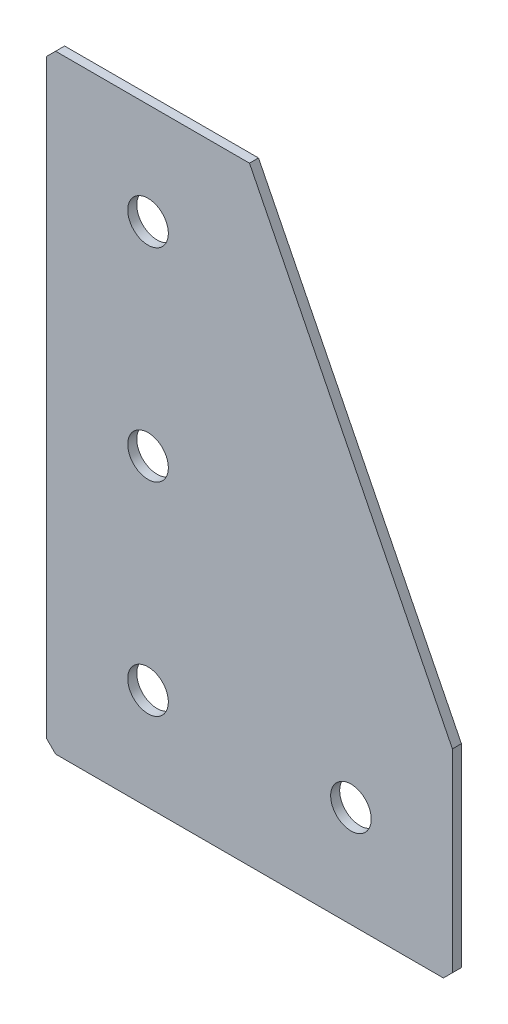
ISO-10303-21;
HEADER;
FILE_DESCRIPTION(('STEP AP214'),'2;1');
FILE_NAME('part.step','',(''),(''),'','','');
FILE_SCHEMA(('AUTOMOTIVE_DESIGN { 1 0 10303 214 1 1 1 1 }'));
ENDSEC;
DATA;
#1=APPLICATION_CONTEXT('core data for automotive mechanical design processes');
#2=APPLICATION_PROTOCOL_DEFINITION('international standard','automotive_design',2000,#1);
#3=PRODUCT_CONTEXT('',#1,'mechanical');
#4=PRODUCT('Part','Part','',(#3));
#5=PRODUCT_RELATED_PRODUCT_CATEGORY('part','',(#4));
#6=PRODUCT_DEFINITION_FORMATION('','',#4);
#7=PRODUCT_DEFINITION_CONTEXT('part definition',#1,'design');
#8=PRODUCT_DEFINITION('design','',#6,#7);
#9=PRODUCT_DEFINITION_SHAPE('','',#8);
#10=(LENGTH_UNIT() NAMED_UNIT(*) SI_UNIT(.MILLI.,.METRE.));
#11=(NAMED_UNIT(*) PLANE_ANGLE_UNIT() SI_UNIT($,.RADIAN.));
#12=(NAMED_UNIT(*) SI_UNIT($,.STERADIAN.) SOLID_ANGLE_UNIT());
#13=UNCERTAINTY_MEASURE_WITH_UNIT(LENGTH_MEASURE(1.E-05),#10,'distance_accuracy_value','');
#14=(GEOMETRIC_REPRESENTATION_CONTEXT(3) GLOBAL_UNCERTAINTY_ASSIGNED_CONTEXT((#13)) GLOBAL_UNIT_ASSIGNED_CONTEXT((#10,
#11,#12)) REPRESENTATION_CONTEXT('',''));
#15=CARTESIAN_POINT('',(0.,0.,0.));
#16=DIRECTION('',(0.,0.,1.));
#17=DIRECTION('',(1.,0.,0.));
#18=AXIS2_PLACEMENT_3D('',#15,#16,#17);
#19=CARTESIAN_POINT('',(45.,0.,-2.));
#20=DIRECTION('',(0.,-1.,0.));
#21=DIRECTION('',(1.,0.,0.));
#22=AXIS2_PLACEMENT_3D('',#19,#20,#21);
#23=PLANE('',#22);
#24=DIRECTION('',(1.,0.,0.));
#25=VECTOR('',#24,1.);
#26=CARTESIAN_POINT('',(45.,0.,-2.));
#27=LINE('',#26,#25);
#28=CARTESIAN_POINT('',(2.,0.,-2.));
#29=VERTEX_POINT('',#28);
#30=CARTESIAN_POINT('',(45.,0.,-2.));
#31=VERTEX_POINT('',#30);
#32=EDGE_CURVE('E110',#29,#31,#27,.T.);
#33=ORIENTED_EDGE('',*,*,#32,.F.);
#34=DIRECTION('',(0.,0.,1.));
#35=VECTOR('',#34,1.);
#36=CARTESIAN_POINT('',(1.99999999999999,0.,-2.));
#37=LINE('',#36,#35);
#38=CARTESIAN_POINT('',(2.,0.,0.));
#39=VERTEX_POINT('',#38);
#40=EDGE_CURVE('E139',#29,#39,#37,.T.);
#41=ORIENTED_EDGE('',*,*,#40,.T.);
#42=DIRECTION('',(1.,0.,0.));
#43=VECTOR('',#42,1.);
#44=CARTESIAN_POINT('',(45.,0.,0.));
#45=LINE('',#44,#43);
#46=CARTESIAN_POINT('',(45.,0.,0.));
#47=VERTEX_POINT('',#46);
#48=EDGE_CURVE('E136',#39,#47,#45,.T.);
#49=ORIENTED_EDGE('',*,*,#48,.T.);
#50=DIRECTION('',(0.,0.,1.));
#51=VECTOR('',#50,1.);
#52=CARTESIAN_POINT('',(45.,0.,-2.));
#53=LINE('',#52,#51);
#54=EDGE_CURVE('E128',#31,#47,#53,.T.);
#55=ORIENTED_EDGE('',*,*,#54,.F.);
#56=EDGE_LOOP('',(#33,#41,#49,#55));
#57=FACE_BOUND('',#56,.T.);
#58=ADVANCED_FACE('F45',(#57),#23,.F.);
#59=CARTESIAN_POINT('',(90.,-90.,-2.));
#60=DIRECTION('',(-0.894427190999916,-0.447213595499958,0.));
#61=DIRECTION('',(0.447213595499958,-0.894427190999916,0.));
#62=AXIS2_PLACEMENT_3D('',#59,#60,#61);
#63=PLANE('',#62);
#64=DIRECTION('',(0.447213595499958,-0.894427190999916,0.));
#65=VECTOR('',#64,1.);
#66=CARTESIAN_POINT('',(90.,-90.,0.));
#67=LINE('',#66,#65);
#68=CARTESIAN_POINT('',(90.,-90.,0.));
#69=VERTEX_POINT('',#68);
#70=EDGE_CURVE('E197',#47,#69,#67,.T.);
#71=ORIENTED_EDGE('',*,*,#70,.T.);
#72=DIRECTION('',(0.,0.,1.));
#73=VECTOR('',#72,1.);
#74=CARTESIAN_POINT('',(90.,-90.,-2.));
#75=LINE('',#74,#73);
#76=CARTESIAN_POINT('',(90.,-90.,-2.));
#77=VERTEX_POINT('',#76);
#78=EDGE_CURVE('E130',#77,#69,#75,.T.);
#79=ORIENTED_EDGE('',*,*,#78,.F.);
#80=DIRECTION('',(0.447213595499958,-0.894427190999916,0.));
#81=VECTOR('',#80,1.);
#82=CARTESIAN_POINT('',(90.,-90.,-2.));
#83=LINE('',#82,#81);
#84=EDGE_CURVE('E114',#31,#77,#83,.T.);
#85=ORIENTED_EDGE('',*,*,#84,.F.);
#86=ORIENTED_EDGE('',*,*,#54,.T.);
#87=EDGE_LOOP('',(#71,#79,#85,#86));
#88=FACE_BOUND('',#87,.T.);
#89=ADVANCED_FACE('F127',(#88),#63,.F.);
#90=CARTESIAN_POINT('',(90.,-135.,-2.));
#91=DIRECTION('',(-1.,0.,0.));
#92=DIRECTION('',(0.,0.,1.));
#93=AXIS2_PLACEMENT_3D('',#90,#91,#92);
#94=PLANE('',#93);
#95=DIRECTION('',(0.,-1.,0.));
#96=VECTOR('',#95,1.);
#97=CARTESIAN_POINT('',(90.,-135.,0.));
#98=LINE('',#97,#96);
#99=CARTESIAN_POINT('',(90.,-133.,0.));
#100=VERTEX_POINT('',#99);
#101=EDGE_CURVE('E190',#69,#100,#98,.T.);
#102=ORIENTED_EDGE('',*,*,#101,.T.);
#103=DIRECTION('',(0.,0.,-1.));
#104=VECTOR('',#103,1.);
#105=CARTESIAN_POINT('',(90.,-133.,-2.));
#106=LINE('',#105,#104);
#107=CARTESIAN_POINT('',(90.,-133.,-2.));
#108=VERTEX_POINT('',#107);
#109=EDGE_CURVE('E11',#100,#108,#106,.T.);
#110=ORIENTED_EDGE('',*,*,#109,.T.);
#111=DIRECTION('',(0.,-1.,0.));
#112=VECTOR('',#111,1.);
#113=CARTESIAN_POINT('',(90.,-135.,-2.));
#114=LINE('',#113,#112);
#115=EDGE_CURVE('E133',#77,#108,#114,.T.);
#116=ORIENTED_EDGE('',*,*,#115,.F.);
#117=ORIENTED_EDGE('',*,*,#78,.T.);
#118=EDGE_LOOP('',(#102,#110,#116,#117));
#119=FACE_BOUND('',#118,.T.);
#120=ADVANCED_FACE('F277',(#119),#94,.F.);
#121=CARTESIAN_POINT('',(0.,-135.,-2.));
#122=DIRECTION('',(0.,1.,0.));
#123=DIRECTION('',(0.,0.,1.));
#124=AXIS2_PLACEMENT_3D('',#121,#122,#123);
#125=PLANE('',#124);
#126=DIRECTION('',(-1.,0.,0.));
#127=VECTOR('',#126,1.);
#128=CARTESIAN_POINT('',(0.,-135.,-2.));
#129=LINE('',#128,#127);
#130=CARTESIAN_POINT('',(88.,-135.,-2.));
#131=VERTEX_POINT('',#130);
#132=CARTESIAN_POINT('',(2.,-135.,-2.));
#133=VERTEX_POINT('',#132);
#134=EDGE_CURVE('E182',#131,#133,#129,.T.);
#135=ORIENTED_EDGE('',*,*,#134,.F.);
#136=DIRECTION('',(0.,0.,1.));
#137=VECTOR('',#136,1.);
#138=CARTESIAN_POINT('',(88.,-135.,-2.));
#139=LINE('',#138,#137);
#140=CARTESIAN_POINT('',(88.,-135.,0.));
#141=VERTEX_POINT('',#140);
#142=EDGE_CURVE('E54',#131,#141,#139,.T.);
#143=ORIENTED_EDGE('',*,*,#142,.T.);
#144=DIRECTION('',(-1.,0.,0.));
#145=VECTOR('',#144,1.);
#146=CARTESIAN_POINT('',(0.,-135.,0.));
#147=LINE('',#146,#145);
#148=CARTESIAN_POINT('',(2.,-135.,0.));
#149=VERTEX_POINT('',#148);
#150=EDGE_CURVE('E181',#141,#149,#147,.T.);
#151=ORIENTED_EDGE('',*,*,#150,.T.);
#152=DIRECTION('',(0.,0.,-1.));
#153=VECTOR('',#152,1.);
#154=CARTESIAN_POINT('',(2.,-135.,-2.));
#155=LINE('',#154,#153);
#156=EDGE_CURVE('E61',#149,#133,#155,.T.);
#157=ORIENTED_EDGE('',*,*,#156,.T.);
#158=EDGE_LOOP('',(#135,#143,#151,#157));
#159=FACE_BOUND('',#158,.T.);
#160=ADVANCED_FACE('F180',(#159),#125,.F.);
#161=CARTESIAN_POINT('',(0.,0.,-2.));
#162=DIRECTION('',(1.,0.,0.));
#163=DIRECTION('',(0.,0.,-1.));
#164=AXIS2_PLACEMENT_3D('',#161,#162,#163);
#165=PLANE('',#164);
#166=DIRECTION('',(0.,1.,0.));
#167=VECTOR('',#166,1.);
#168=CARTESIAN_POINT('',(0.,0.,0.));
#169=LINE('',#168,#167);
#170=CARTESIAN_POINT('',(0.,-133.,0.));
#171=VERTEX_POINT('',#170);
#172=CARTESIAN_POINT('',(0.,-2.,0.));
#173=VERTEX_POINT('',#172);
#174=EDGE_CURVE('E123',#171,#173,#169,.T.);
#175=ORIENTED_EDGE('',*,*,#174,.T.);
#176=DIRECTION('',(0.,0.,-1.));
#177=VECTOR('',#176,1.);
#178=CARTESIAN_POINT('',(0.,-2.,-2.));
#179=LINE('',#178,#177);
#180=CARTESIAN_POINT('',(0.,-2.,-2.));
#181=VERTEX_POINT('',#180);
#182=EDGE_CURVE('E163',#173,#181,#179,.T.);
#183=ORIENTED_EDGE('',*,*,#182,.T.);
#184=DIRECTION('',(0.,1.,0.));
#185=VECTOR('',#184,1.);
#186=CARTESIAN_POINT('',(0.,0.,-2.));
#187=LINE('',#186,#185);
#188=CARTESIAN_POINT('',(0.,-133.,-2.));
#189=VERTEX_POINT('',#188);
#190=EDGE_CURVE('E147',#189,#181,#187,.T.);
#191=ORIENTED_EDGE('',*,*,#190,.F.);
#192=DIRECTION('',(0.,0.,1.));
#193=VECTOR('',#192,1.);
#194=CARTESIAN_POINT('',(0.,-133.,-2.));
#195=LINE('',#194,#193);
#196=EDGE_CURVE('E159',#189,#171,#195,.T.);
#197=ORIENTED_EDGE('',*,*,#196,.T.);
#198=EDGE_LOOP('',(#175,#183,#191,#197));
#199=FACE_BOUND('',#198,.T.);
#200=ADVANCED_FACE('F249',(#199),#165,.F.);
#201=CARTESIAN_POINT('',(0.,0.,-2.));
#202=DIRECTION('',(0.,0.,1.));
#203=DIRECTION('',(1.,0.,0.));
#204=AXIS2_PLACEMENT_3D('',#201,#202,#203);
#205=PLANE('',#204);
#206=CARTESIAN_POINT('',(67.5,-112.5,-2.00000000000001));
#207=DIRECTION('',(0.,0.,-1.));
#208=DIRECTION('',(0.,1.,0.));
#209=AXIS2_PLACEMENT_3D('',#206,#207,#208);
#210=CIRCLE('',#209,4.5);
#211=CARTESIAN_POINT('',(67.5,-108.,-2.00000000000001));
#212=VERTEX_POINT('',#211);
#213=EDGE_CURVE('E238',#212,#212,#210,.T.);
#214=ORIENTED_EDGE('',*,*,#213,.F.);
#215=EDGE_LOOP('',(#214));
#216=FACE_BOUND('',#215,.T.);
#217=CARTESIAN_POINT('',(22.5,-112.5,-2.00000000000001));
#218=DIRECTION('',(0.,0.,-1.));
#219=DIRECTION('',(0.,1.,0.));
#220=AXIS2_PLACEMENT_3D('',#217,#218,#219);
#221=CIRCLE('',#220,4.5);
#222=CARTESIAN_POINT('',(22.5,-108.,-2.00000000000001));
#223=VERTEX_POINT('',#222);
#224=EDGE_CURVE('E230',#223,#223,#221,.T.);
#225=ORIENTED_EDGE('',*,*,#224,.F.);
#226=EDGE_LOOP('',(#225));
#227=FACE_BOUND('',#226,.T.);
#228=CARTESIAN_POINT('',(22.5,-67.5,-2.));
#229=DIRECTION('',(0.,0.,-1.));
#230=DIRECTION('',(0.,1.,0.));
#231=AXIS2_PLACEMENT_3D('',#228,#229,#230);
#232=CIRCLE('',#231,4.5);
#233=CARTESIAN_POINT('',(22.5,-63.,-2.));
#234=VERTEX_POINT('',#233);
#235=EDGE_CURVE('E222',#234,#234,#232,.T.);
#236=ORIENTED_EDGE('',*,*,#235,.F.);
#237=EDGE_LOOP('',(#236));
#238=FACE_BOUND('',#237,.T.);
#239=CARTESIAN_POINT('',(22.5,-22.5,-2.));
#240=DIRECTION('',(0.,0.,-1.));
#241=DIRECTION('',(0.,1.,0.));
#242=AXIS2_PLACEMENT_3D('',#239,#240,#241);
#243=CIRCLE('',#242,4.5);
#244=CARTESIAN_POINT('',(22.5,-18.,-2.));
#245=VERTEX_POINT('',#244);
#246=EDGE_CURVE('E214',#245,#245,#243,.T.);
#247=ORIENTED_EDGE('',*,*,#246,.F.);
#248=EDGE_LOOP('',(#247));
#249=FACE_BOUND('',#248,.T.);
#250=ORIENTED_EDGE('',*,*,#190,.T.);
#251=DIRECTION('',(-0.707106781186545,-0.70710678118655,0.));
#252=VECTOR('',#251,1.);
#253=CARTESIAN_POINT('',(1.99999999999999,0.,-2.));
#254=LINE('',#253,#252);
#255=EDGE_CURVE('E117',#181,#29,#254,.F.);
#256=ORIENTED_EDGE('',*,*,#255,.T.);
#257=ORIENTED_EDGE('',*,*,#32,.T.);
#258=ORIENTED_EDGE('',*,*,#84,.T.);
#259=ORIENTED_EDGE('',*,*,#115,.T.);
#260=DIRECTION('',(0.707106781186543,0.707106781186552,0.));
#261=VECTOR('',#260,1.);
#262=CARTESIAN_POINT('',(88.,-135.,-2.));
#263=LINE('',#262,#261);
#264=EDGE_CURVE('E68',#108,#131,#263,.F.);
#265=ORIENTED_EDGE('',*,*,#264,.T.);
#266=ORIENTED_EDGE('',*,*,#134,.T.);
#267=DIRECTION('',(0.707106781186548,-0.707106781186548,0.));
#268=VECTOR('',#267,1.);
#269=CARTESIAN_POINT('',(0.,-133.,-2.));
#270=LINE('',#269,#268);
#271=EDGE_CURVE('E166',#133,#189,#270,.F.);
#272=ORIENTED_EDGE('',*,*,#271,.T.);
#273=EDGE_LOOP('',(#250,#256,#257,#258,#259,#265,#266,#272));
#274=FACE_BOUND('',#273,.T.);
#275=ADVANCED_FACE('F113',(#216,#227,#238,#249,#274),#205,.F.);
#276=CARTESIAN_POINT('',(0.,0.,0.));
#277=DIRECTION('',(0.,0.,1.));
#278=DIRECTION('',(1.,0.,0.));
#279=AXIS2_PLACEMENT_3D('',#276,#277,#278);
#280=PLANE('',#279);
#281=CARTESIAN_POINT('',(67.5,-112.5,0.));
#282=DIRECTION('',(0.,0.,-1.));
#283=DIRECTION('',(0.,1.,0.));
#284=AXIS2_PLACEMENT_3D('',#281,#282,#283);
#285=CIRCLE('',#284,4.5);
#286=CARTESIAN_POINT('',(67.5,-108.,0.));
#287=VERTEX_POINT('',#286);
#288=EDGE_CURVE('E234',#287,#287,#285,.T.);
#289=ORIENTED_EDGE('',*,*,#288,.T.);
#290=EDGE_LOOP('',(#289));
#291=FACE_BOUND('',#290,.T.);
#292=CARTESIAN_POINT('',(22.5,-112.5,0.));
#293=DIRECTION('',(0.,0.,-1.));
#294=DIRECTION('',(0.,1.,0.));
#295=AXIS2_PLACEMENT_3D('',#292,#293,#294);
#296=CIRCLE('',#295,4.5);
#297=CARTESIAN_POINT('',(22.5,-108.,0.));
#298=VERTEX_POINT('',#297);
#299=EDGE_CURVE('E226',#298,#298,#296,.T.);
#300=ORIENTED_EDGE('',*,*,#299,.T.);
#301=EDGE_LOOP('',(#300));
#302=FACE_BOUND('',#301,.T.);
#303=CARTESIAN_POINT('',(22.5,-67.5,0.));
#304=DIRECTION('',(0.,0.,-1.));
#305=DIRECTION('',(0.,1.,0.));
#306=AXIS2_PLACEMENT_3D('',#303,#304,#305);
#307=CIRCLE('',#306,4.5);
#308=CARTESIAN_POINT('',(22.5,-63.,0.));
#309=VERTEX_POINT('',#308);
#310=EDGE_CURVE('E218',#309,#309,#307,.T.);
#311=ORIENTED_EDGE('',*,*,#310,.T.);
#312=EDGE_LOOP('',(#311));
#313=FACE_BOUND('',#312,.T.);
#314=CARTESIAN_POINT('',(22.5,-22.5,0.));
#315=DIRECTION('',(0.,0.,-1.));
#316=DIRECTION('',(0.,1.,0.));
#317=AXIS2_PLACEMENT_3D('',#314,#315,#316);
#318=CIRCLE('',#317,4.5);
#319=CARTESIAN_POINT('',(22.5,-18.,0.));
#320=VERTEX_POINT('',#319);
#321=EDGE_CURVE('E204',#320,#320,#318,.T.);
#322=ORIENTED_EDGE('',*,*,#321,.T.);
#323=EDGE_LOOP('',(#322));
#324=FACE_BOUND('',#323,.T.);
#325=ORIENTED_EDGE('',*,*,#48,.F.);
#326=DIRECTION('',(0.707106781186545,0.70710678118655,0.));
#327=VECTOR('',#326,1.);
#328=CARTESIAN_POINT('',(1.,-0.999999999999994,0.));
#329=LINE('',#328,#327);
#330=EDGE_CURVE('E156',#39,#173,#329,.F.);
#331=ORIENTED_EDGE('',*,*,#330,.T.);
#332=ORIENTED_EDGE('',*,*,#174,.F.);
#333=DIRECTION('',(-0.707106781186548,0.707106781186548,0.));
#334=VECTOR('',#333,1.);
#335=CARTESIAN_POINT('',(-66.5,-66.5,0.));
#336=LINE('',#335,#334);
#337=EDGE_CURVE('E145',#171,#149,#336,.F.);
#338=ORIENTED_EDGE('',*,*,#337,.T.);
#339=ORIENTED_EDGE('',*,*,#150,.F.);
#340=DIRECTION('',(-0.707106781186543,-0.707106781186552,0.));
#341=VECTOR('',#340,1.);
#342=CARTESIAN_POINT('',(111.500000000001,-111.499999999999,0.));
#343=LINE('',#342,#341);
#344=EDGE_CURVE('E153',#141,#100,#343,.F.);
#345=ORIENTED_EDGE('',*,*,#344,.T.);
#346=ORIENTED_EDGE('',*,*,#101,.F.);
#347=ORIENTED_EDGE('',*,*,#70,.F.);
#348=EDGE_LOOP('',(#325,#331,#332,#338,#339,#345,#346,#347));
#349=FACE_BOUND('',#348,.T.);
#350=ADVANCED_FACE('F185',(#291,#302,#313,#324,#349),#280,.T.);
#351=CARTESIAN_POINT('',(22.5,-22.5,-2.));
#352=DIRECTION('',(0.,0.,-1.));
#353=DIRECTION('',(0.,1.,0.));
#354=AXIS2_PLACEMENT_3D('',#351,#352,#353);
#355=CYLINDRICAL_SURFACE('',#354,4.5);
#356=ORIENTED_EDGE('',*,*,#321,.F.);
#357=EDGE_LOOP('',(#356));
#358=FACE_BOUND('',#357,.T.);
#359=ORIENTED_EDGE('',*,*,#246,.T.);
#360=EDGE_LOOP('',(#359));
#361=FACE_BOUND('',#360,.T.);
#362=ADVANCED_FACE('F257',(#358,#361),#355,.F.);
#363=CARTESIAN_POINT('',(22.5,-67.5,-2.));
#364=DIRECTION('',(0.,0.,-1.));
#365=DIRECTION('',(0.,1.,0.));
#366=AXIS2_PLACEMENT_3D('',#363,#364,#365);
#367=CYLINDRICAL_SURFACE('',#366,4.5);
#368=ORIENTED_EDGE('',*,*,#310,.F.);
#369=EDGE_LOOP('',(#368));
#370=FACE_BOUND('',#369,.T.);
#371=ORIENTED_EDGE('',*,*,#235,.T.);
#372=EDGE_LOOP('',(#371));
#373=FACE_BOUND('',#372,.T.);
#374=ADVANCED_FACE('F259',(#370,#373),#367,.F.);
#375=CARTESIAN_POINT('',(22.5,-112.5,-2.00000000000001));
#376=DIRECTION('',(0.,0.,-1.));
#377=DIRECTION('',(0.,1.,0.));
#378=AXIS2_PLACEMENT_3D('',#375,#376,#377);
#379=CYLINDRICAL_SURFACE('',#378,4.5);
#380=ORIENTED_EDGE('',*,*,#299,.F.);
#381=EDGE_LOOP('',(#380));
#382=FACE_BOUND('',#381,.T.);
#383=ORIENTED_EDGE('',*,*,#224,.T.);
#384=EDGE_LOOP('',(#383));
#385=FACE_BOUND('',#384,.T.);
#386=ADVANCED_FACE('F266',(#382,#385),#379,.F.);
#387=CARTESIAN_POINT('',(67.5,-112.5,-2.00000000000001));
#388=DIRECTION('',(0.,0.,-1.));
#389=DIRECTION('',(0.,1.,0.));
#390=AXIS2_PLACEMENT_3D('',#387,#388,#389);
#391=CYLINDRICAL_SURFACE('',#390,4.5);
#392=ORIENTED_EDGE('',*,*,#288,.F.);
#393=EDGE_LOOP('',(#392));
#394=FACE_BOUND('',#393,.T.);
#395=ORIENTED_EDGE('',*,*,#213,.T.);
#396=EDGE_LOOP('',(#395));
#397=FACE_BOUND('',#396,.T.);
#398=ADVANCED_FACE('F245',(#394,#397),#391,.F.);
#399=CARTESIAN_POINT('',(1.99999999999999,0.,-2.));
#400=DIRECTION('',(0.70710678118655,-0.707106781186545,0.));
#401=DIRECTION('',(0.,0.,1.));
#402=AXIS2_PLACEMENT_3D('',#399,#400,#401);
#403=PLANE('',#402);
#404=ORIENTED_EDGE('',*,*,#255,.F.);
#405=ORIENTED_EDGE('',*,*,#182,.F.);
#406=ORIENTED_EDGE('',*,*,#330,.F.);
#407=ORIENTED_EDGE('',*,*,#40,.F.);
#408=EDGE_LOOP('',(#404,#405,#406,#407));
#409=FACE_BOUND('',#408,.T.);
#410=ADVANCED_FACE('F281',(#409),#403,.F.);
#411=CARTESIAN_POINT('',(88.,-135.,-2.));
#412=DIRECTION('',(-0.707106781186552,0.707106781186542,0.));
#413=DIRECTION('',(0.,0.,1.));
#414=AXIS2_PLACEMENT_3D('',#411,#412,#413);
#415=PLANE('',#414);
#416=ORIENTED_EDGE('',*,*,#264,.F.);
#417=ORIENTED_EDGE('',*,*,#109,.F.);
#418=ORIENTED_EDGE('',*,*,#344,.F.);
#419=ORIENTED_EDGE('',*,*,#142,.F.);
#420=EDGE_LOOP('',(#416,#417,#418,#419));
#421=FACE_BOUND('',#420,.T.);
#422=ADVANCED_FACE('F283',(#421),#415,.F.);
#423=CARTESIAN_POINT('',(0.,-133.,-2.));
#424=DIRECTION('',(0.707106781186547,0.707106781186547,0.));
#425=DIRECTION('',(0.,0.,1.));
#426=AXIS2_PLACEMENT_3D('',#423,#424,#425);
#427=PLANE('',#426);
#428=ORIENTED_EDGE('',*,*,#271,.F.);
#429=ORIENTED_EDGE('',*,*,#156,.F.);
#430=ORIENTED_EDGE('',*,*,#337,.F.);
#431=ORIENTED_EDGE('',*,*,#196,.F.);
#432=EDGE_LOOP('',(#428,#429,#430,#431));
#433=FACE_BOUND('',#432,.T.);
#434=ADVANCED_FACE('F47',(#433),#427,.F.);
#435=CLOSED_SHELL('',(#58,#89,#120,#160,#200,#275,#350,#362,#374,#386,#398,#410,#422,#434));
#436=MANIFOLD_SOLID_BREP('B2',#435);
#437=ADVANCED_BREP_SHAPE_REPRESENTATION('',(#18,#436),#14);
#438=SHAPE_DEFINITION_REPRESENTATION(#9,#437);
ENDSEC;
END-ISO-10303-21;
